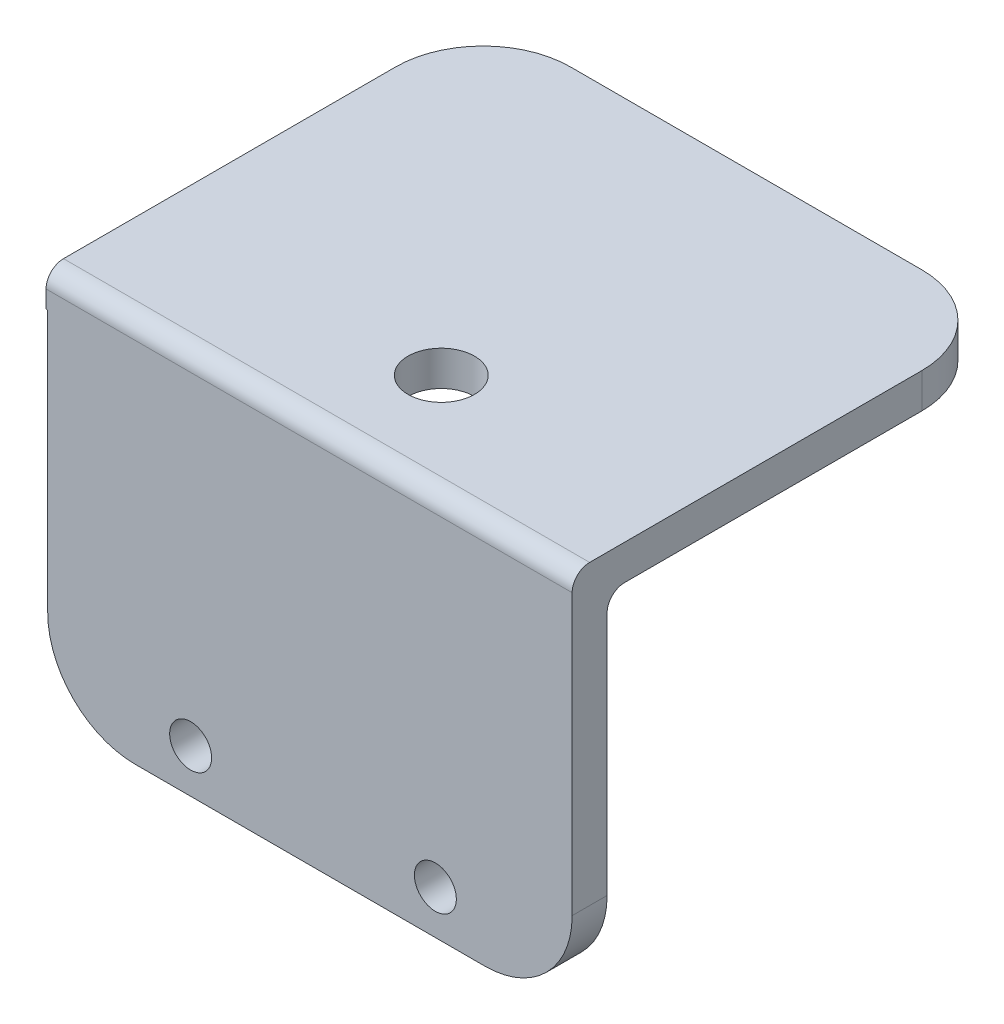
ISO-10303-21;
HEADER;
FILE_DESCRIPTION(('STEP AP214'),'2;1');
FILE_NAME('part.step','',(''),(''),'','','');
FILE_SCHEMA(('AUTOMOTIVE_DESIGN { 1 0 10303 214 1 1 1 1 }'));
ENDSEC;
DATA;
#1=APPLICATION_CONTEXT('core data for automotive mechanical design processes');
#2=APPLICATION_PROTOCOL_DEFINITION('international standard','automotive_design',2000,#1);
#3=PRODUCT_CONTEXT('',#1,'mechanical');
#4=PRODUCT('Part','Part','',(#3));
#5=PRODUCT_RELATED_PRODUCT_CATEGORY('part','',(#4));
#6=PRODUCT_DEFINITION_FORMATION('','',#4);
#7=PRODUCT_DEFINITION_CONTEXT('part definition',#1,'design');
#8=PRODUCT_DEFINITION('design','',#6,#7);
#9=PRODUCT_DEFINITION_SHAPE('','',#8);
#10=(LENGTH_UNIT() NAMED_UNIT(*) SI_UNIT(.MILLI.,.METRE.));
#11=(NAMED_UNIT(*) PLANE_ANGLE_UNIT() SI_UNIT($,.RADIAN.));
#12=(NAMED_UNIT(*) SI_UNIT($,.STERADIAN.) SOLID_ANGLE_UNIT());
#13=UNCERTAINTY_MEASURE_WITH_UNIT(LENGTH_MEASURE(1.E-05),#10,'distance_accuracy_value','');
#14=(GEOMETRIC_REPRESENTATION_CONTEXT(3) GLOBAL_UNCERTAINTY_ASSIGNED_CONTEXT((#13)) GLOBAL_UNIT_ASSIGNED_CONTEXT((#10,
#11,#12)) REPRESENTATION_CONTEXT('',''));
#15=CARTESIAN_POINT('',(0.,0.,0.));
#16=DIRECTION('',(0.,0.,1.));
#17=DIRECTION('',(1.,0.,0.));
#18=AXIS2_PLACEMENT_3D('',#15,#16,#17);
#19=CARTESIAN_POINT('',(2.62467610196418,-0.400000000000136,2.));
#20=DIRECTION('',(-1.,0.,0.));
#21=DIRECTION('',(0.,0.,1.));
#22=AXIS2_PLACEMENT_3D('',#19,#20,#21);
#23=PLANE('',#22);
#24=DIRECTION('',(0.,0.,-1.));
#25=VECTOR('',#24,1.);
#26=CARTESIAN_POINT('',(2.62467610196418,19.5999999999999,2.));
#27=LINE('',#26,#25);
#28=CARTESIAN_POINT('',(2.62467610196418,19.5999999999999,-1.));
#29=VERTEX_POINT('',#28);
#30=CARTESIAN_POINT('',(2.62467610196418,19.5999999999999,-18.));
#31=VERTEX_POINT('',#30);
#32=EDGE_CURVE('E144',#29,#31,#27,.T.);
#33=ORIENTED_EDGE('',*,*,#32,.T.);
#34=DIRECTION('',(0.,1.,0.));
#35=VECTOR('',#34,1.);
#36=CARTESIAN_POINT('',(2.62467610196418,21.5999999999999,-18.));
#37=LINE('',#36,#35);
#38=CARTESIAN_POINT('',(2.62467610196418,21.5999999999999,-18.));
#39=VERTEX_POINT('',#38);
#40=EDGE_CURVE('E11',#31,#39,#37,.T.);
#41=ORIENTED_EDGE('',*,*,#40,.T.);
#42=DIRECTION('',(0.,0.,-1.));
#43=VECTOR('',#42,1.);
#44=CARTESIAN_POINT('',(2.62467610196418,21.5999999999999,2.));
#45=LINE('',#44,#43);
#46=CARTESIAN_POINT('',(2.62467610196418,21.5999999999999,1.));
#47=VERTEX_POINT('',#46);
#48=EDGE_CURVE('E177',#47,#39,#45,.T.);
#49=ORIENTED_EDGE('',*,*,#48,.F.);
#50=CARTESIAN_POINT('',(2.62467610196418,20.5999999999999,1.));
#51=DIRECTION('',(-1.,0.,0.));
#52=DIRECTION('',(0.,0.,1.));
#53=AXIS2_PLACEMENT_3D('',#50,#51,#52);
#54=CIRCLE('',#53,1.);
#55=CARTESIAN_POINT('',(2.62467610196418,20.5999999999999,2.));
#56=VERTEX_POINT('',#55);
#57=EDGE_CURVE('E200',#47,#56,#54,.F.);
#58=ORIENTED_EDGE('',*,*,#57,.T.);
#59=DIRECTION('',(0.,1.,0.));
#60=VECTOR('',#59,1.);
#61=CARTESIAN_POINT('',(2.62467610196418,-0.400000000000136,2.));
#62=LINE('',#61,#60);
#63=CARTESIAN_POINT('',(2.62467610196418,4.59999999999986,2.));
#64=VERTEX_POINT('',#63);
#65=EDGE_CURVE('E170',#64,#56,#62,.T.);
#66=ORIENTED_EDGE('',*,*,#65,.F.);
#67=DIRECTION('',(0.,0.,-1.));
#68=VECTOR('',#67,1.);
#69=CARTESIAN_POINT('',(2.62467610196418,4.59999999999986,2.));
#70=LINE('',#69,#68);
#71=CARTESIAN_POINT('',(2.62467610196418,4.59999999999986,0.));
#72=VERTEX_POINT('',#71);
#73=EDGE_CURVE('E203',#64,#72,#70,.T.);
#74=ORIENTED_EDGE('',*,*,#73,.T.);
#75=DIRECTION('',(0.,1.,0.));
#76=VECTOR('',#75,1.);
#77=CARTESIAN_POINT('',(2.62467610196418,-0.400000000000136,0.));
#78=LINE('',#77,#76);
#79=CARTESIAN_POINT('',(2.62467610196418,18.5999999999999,0.));
#80=VERTEX_POINT('',#79);
#81=EDGE_CURVE('E169',#72,#80,#78,.T.);
#82=ORIENTED_EDGE('',*,*,#81,.T.);
#83=CARTESIAN_POINT('',(2.62467610196418,18.5999999999999,-1.));
#84=DIRECTION('',(-1.,0.,0.));
#85=DIRECTION('',(0.,0.,1.));
#86=AXIS2_PLACEMENT_3D('',#83,#84,#85);
#87=CIRCLE('',#86,1.);
#88=EDGE_CURVE('E191',#80,#29,#87,.T.);
#89=ORIENTED_EDGE('',*,*,#88,.T.);
#90=EDGE_LOOP('',(#33,#41,#49,#58,#66,#74,#82,#89));
#91=FACE_BOUND('',#90,.T.);
#92=ADVANCED_FACE('F37',(#91),#23,.F.);
#93=CARTESIAN_POINT('',(2.62467610196418,21.5999999999999,2.));
#94=DIRECTION('',(0.,-1.,0.));
#95=DIRECTION('',(0.,0.,-1.));
#96=AXIS2_PLACEMENT_3D('',#93,#94,#95);
#97=PLANE('',#96);
#98=CARTESIAN_POINT('',(-10.8906381891158,21.5999999999999,-4.02767022661771));
#99=DIRECTION('',(0.,1.,0.));
#100=DIRECTION('',(0.,0.,1.));
#101=AXIS2_PLACEMENT_3D('',#98,#99,#100);
#102=CIRCLE('',#101,1.90000000000001);
#103=CARTESIAN_POINT('',(-10.8906381891158,21.5999999999999,-2.1276702266177));
#104=VERTEX_POINT('',#103);
#105=EDGE_CURVE('E348',#104,#104,#102,.T.);
#106=ORIENTED_EDGE('',*,*,#105,.F.);
#107=EDGE_LOOP('',(#106));
#108=FACE_BOUND('',#107,.T.);
#109=DIRECTION('',(-1.,0.,0.));
#110=VECTOR('',#109,1.);
#111=CARTESIAN_POINT('',(2.62467610196418,21.5999999999999,-23.));
#112=LINE('',#111,#110);
#113=CARTESIAN_POINT('',(-2.37532389803582,21.5999999999999,-23.));
#114=VERTEX_POINT('',#113);
#115=CARTESIAN_POINT('',(-22.4723601052632,21.5999999999999,-23.));
#116=VERTEX_POINT('',#115);
#117=EDGE_CURVE('E163',#114,#116,#112,.T.);
#118=ORIENTED_EDGE('',*,*,#117,.T.);
#119=CARTESIAN_POINT('',(-22.4723601052632,21.5999999999999,-18.));
#120=DIRECTION('',(0.,-1.,0.));
#121=DIRECTION('',(0.,0.,-1.));
#122=AXIS2_PLACEMENT_3D('',#119,#120,#121);
#123=CIRCLE('',#122,5.);
#124=CARTESIAN_POINT('',(-27.4723601052632,21.5999999999999,-18.));
#125=VERTEX_POINT('',#124);
#126=EDGE_CURVE('E228',#116,#125,#123,.F.);
#127=ORIENTED_EDGE('',*,*,#126,.T.);
#128=DIRECTION('',(0.,0.,-1.));
#129=VECTOR('',#128,1.);
#130=CARTESIAN_POINT('',(-27.4723601052632,21.5999999999999,2.));
#131=LINE('',#130,#129);
#132=CARTESIAN_POINT('',(-27.4723601052632,21.5999999999999,1.));
#133=VERTEX_POINT('',#132);
#134=EDGE_CURVE('E158',#133,#125,#131,.T.);
#135=ORIENTED_EDGE('',*,*,#134,.F.);
#136=DIRECTION('',(-1.,0.,0.));
#137=VECTOR('',#136,1.);
#138=CARTESIAN_POINT('',(2.62467610196418,21.5999999999999,1.));
#139=LINE('',#138,#137);
#140=EDGE_CURVE('E198',#133,#47,#139,.F.);
#141=ORIENTED_EDGE('',*,*,#140,.T.);
#142=ORIENTED_EDGE('',*,*,#48,.T.);
#143=CARTESIAN_POINT('',(-2.37532389803582,21.5999999999999,-18.));
#144=DIRECTION('',(0.,-1.,0.));
#145=DIRECTION('',(0.,0.,-1.));
#146=AXIS2_PLACEMENT_3D('',#143,#144,#145);
#147=CIRCLE('',#146,5.);
#148=EDGE_CURVE('E226',#39,#114,#147,.F.);
#149=ORIENTED_EDGE('',*,*,#148,.T.);
#150=EDGE_LOOP('',(#118,#127,#135,#141,#142,#149));
#151=FACE_BOUND('',#150,.T.);
#152=ADVANCED_FACE('F240',(#108,#151),#97,.F.);
#153=CARTESIAN_POINT('',(-27.3753238980358,-0.40000000000014,2.));
#154=DIRECTION('',(1.,0.,0.));
#155=DIRECTION('',(0.,0.,-1.));
#156=AXIS2_PLACEMENT_3D('',#153,#154,#155);
#157=PLANE('',#156);
#158=DIRECTION('',(0.,-1.,0.));
#159=VECTOR('',#158,1.);
#160=CARTESIAN_POINT('',(-27.3753238980358,-0.40000000000014,0.));
#161=LINE('',#160,#159);
#162=CARTESIAN_POINT('',(-27.3753238980358,18.5999999999999,0.));
#163=VERTEX_POINT('',#162);
#164=CARTESIAN_POINT('',(-27.3753238980358,4.59999999999986,0.));
#165=VERTEX_POINT('',#164);
#166=EDGE_CURVE('E179',#163,#165,#161,.T.);
#167=ORIENTED_EDGE('',*,*,#166,.T.);
#168=DIRECTION('',(0.,0.,-1.));
#169=VECTOR('',#168,1.);
#170=CARTESIAN_POINT('',(-27.3753238980358,4.59999999999986,2.));
#171=LINE('',#170,#169);
#172=CARTESIAN_POINT('',(-27.3753238980358,4.59999999999986,2.));
#173=VERTEX_POINT('',#172);
#174=EDGE_CURVE('E219',#165,#173,#171,.F.);
#175=ORIENTED_EDGE('',*,*,#174,.T.);
#176=DIRECTION('',(0.,-1.,0.));
#177=VECTOR('',#176,1.);
#178=CARTESIAN_POINT('',(-27.3753238980358,-0.40000000000014,2.));
#179=LINE('',#178,#177);
#180=CARTESIAN_POINT('',(-27.3753238980358,19.5999999999999,2.));
#181=VERTEX_POINT('',#180);
#182=EDGE_CURVE('E172',#181,#173,#179,.T.);
#183=ORIENTED_EDGE('',*,*,#182,.F.);
#184=DIRECTION('',(0.,0.,-1.));
#185=VECTOR('',#184,1.);
#186=CARTESIAN_POINT('',(-27.3753238980358,19.5999999999999,2.));
#187=LINE('',#186,#185);
#188=CARTESIAN_POINT('',(-27.3753238980358,19.5999999999999,-1.));
#189=VERTEX_POINT('',#188);
#190=EDGE_CURVE('E140',#181,#189,#187,.T.);
#191=ORIENTED_EDGE('',*,*,#190,.T.);
#192=CARTESIAN_POINT('',(-27.3753238980358,18.5999999999999,-1.));
#193=DIRECTION('',(1.,0.,0.));
#194=DIRECTION('',(0.,0.,-1.));
#195=AXIS2_PLACEMENT_3D('',#192,#193,#194);
#196=CIRCLE('',#195,1.);
#197=EDGE_CURVE('E193',#189,#163,#196,.T.);
#198=ORIENTED_EDGE('',*,*,#197,.T.);
#199=EDGE_LOOP('',(#167,#175,#183,#191,#198));
#200=FACE_BOUND('',#199,.T.);
#201=ADVANCED_FACE('F264',(#200),#157,.F.);
#202=CARTESIAN_POINT('',(2.62467610196418,-0.400000000000136,2.));
#203=DIRECTION('',(0.,1.,0.));
#204=DIRECTION('',(-1.,0.,0.));
#205=AXIS2_PLACEMENT_3D('',#202,#203,#204);
#206=PLANE('',#205);
#207=DIRECTION('',(1.,0.,0.));
#208=VECTOR('',#207,1.);
#209=CARTESIAN_POINT('',(2.62467610196418,-0.400000000000136,0.));
#210=LINE('',#209,#208);
#211=CARTESIAN_POINT('',(-22.3753238980358,-0.400000000000139,0.));
#212=VERTEX_POINT('',#211);
#213=CARTESIAN_POINT('',(-2.37532389803582,-0.400000000000137,0.));
#214=VERTEX_POINT('',#213);
#215=EDGE_CURVE('E173',#212,#214,#210,.T.);
#216=ORIENTED_EDGE('',*,*,#215,.T.);
#217=DIRECTION('',(0.,0.,-1.));
#218=VECTOR('',#217,1.);
#219=CARTESIAN_POINT('',(-2.37532389803582,-0.400000000000137,2.));
#220=LINE('',#219,#218);
#221=CARTESIAN_POINT('',(-2.37532389803582,-0.400000000000137,2.));
#222=VERTEX_POINT('',#221);
#223=EDGE_CURVE('E213',#214,#222,#220,.F.);
#224=ORIENTED_EDGE('',*,*,#223,.T.);
#225=DIRECTION('',(1.,0.,0.));
#226=VECTOR('',#225,1.);
#227=CARTESIAN_POINT('',(2.62467610196418,-0.400000000000136,2.));
#228=LINE('',#227,#226);
#229=CARTESIAN_POINT('',(-22.3753238980358,-0.400000000000139,2.));
#230=VERTEX_POINT('',#229);
#231=EDGE_CURVE('E175',#230,#222,#228,.T.);
#232=ORIENTED_EDGE('',*,*,#231,.F.);
#233=DIRECTION('',(0.,0.,-1.));
#234=VECTOR('',#233,1.);
#235=CARTESIAN_POINT('',(-22.3753238980358,-0.400000000000139,2.));
#236=LINE('',#235,#234);
#237=EDGE_CURVE('E210',#230,#212,#236,.T.);
#238=ORIENTED_EDGE('',*,*,#237,.T.);
#239=EDGE_LOOP('',(#216,#224,#232,#238));
#240=FACE_BOUND('',#239,.T.);
#241=ADVANCED_FACE('F290',(#240),#206,.F.);
#242=CARTESIAN_POINT('',(0.,0.,2.));
#243=DIRECTION('',(0.,0.,1.));
#244=DIRECTION('',(1.,0.,0.));
#245=AXIS2_PLACEMENT_3D('',#242,#243,#244);
#246=PLANE('',#245);
#247=CARTESIAN_POINT('',(-5.2,2.09999999999999,2.));
#248=DIRECTION('',(0.,0.,1.));
#249=DIRECTION('',(1.,0.,0.));
#250=AXIS2_PLACEMENT_3D('',#247,#248,#249);
#251=CIRCLE('',#250,1.2);
#252=CARTESIAN_POINT('',(-4.,2.09999999999999,2.));
#253=VERTEX_POINT('',#252);
#254=EDGE_CURVE('E335',#253,#253,#251,.T.);
#255=ORIENTED_EDGE('',*,*,#254,.F.);
#256=EDGE_LOOP('',(#255));
#257=FACE_BOUND('',#256,.T.);
#258=CARTESIAN_POINT('',(-19.2,2.09999999999999,2.));
#259=DIRECTION('',(0.,0.,1.));
#260=DIRECTION('',(1.,0.,0.));
#261=AXIS2_PLACEMENT_3D('',#258,#259,#260);
#262=CIRCLE('',#261,1.2);
#263=CARTESIAN_POINT('',(-18.,2.09999999999999,2.));
#264=VERTEX_POINT('',#263);
#265=EDGE_CURVE('E340',#264,#264,#262,.T.);
#266=ORIENTED_EDGE('',*,*,#265,.F.);
#267=EDGE_LOOP('',(#266));
#268=FACE_BOUND('',#267,.T.);
#269=ORIENTED_EDGE('',*,*,#231,.T.);
#270=CARTESIAN_POINT('',(-2.37532389803582,4.59999999999986,2.));
#271=DIRECTION('',(0.,0.,1.));
#272=DIRECTION('',(1.,0.,0.));
#273=AXIS2_PLACEMENT_3D('',#270,#271,#272);
#274=CIRCLE('',#273,5.);
#275=EDGE_CURVE('E217',#222,#64,#274,.T.);
#276=ORIENTED_EDGE('',*,*,#275,.T.);
#277=ORIENTED_EDGE('',*,*,#65,.T.);
#278=DIRECTION('',(-1.,0.,0.));
#279=VECTOR('',#278,1.);
#280=CARTESIAN_POINT('',(-27.4723601052632,20.5999999999999,2.));
#281=LINE('',#280,#279);
#282=CARTESIAN_POINT('',(-27.4723601052632,20.5999999999999,2.));
#283=VERTEX_POINT('',#282);
#284=EDGE_CURVE('E152',#56,#283,#281,.T.);
#285=ORIENTED_EDGE('',*,*,#284,.T.);
#286=DIRECTION('',(0.,1.,0.));
#287=VECTOR('',#286,1.);
#288=CARTESIAN_POINT('',(-27.4723601052632,19.5999999999999,2.));
#289=LINE('',#288,#287);
#290=CARTESIAN_POINT('',(-27.4723601052632,19.5999999999999,2.));
#291=VERTEX_POINT('',#290);
#292=EDGE_CURVE('E148',#291,#283,#289,.T.);
#293=ORIENTED_EDGE('',*,*,#292,.F.);
#294=DIRECTION('',(-1.,0.,0.));
#295=VECTOR('',#294,1.);
#296=CARTESIAN_POINT('',(2.62467610196418,19.5999999999999,2.));
#297=LINE('',#296,#295);
#298=EDGE_CURVE('E134',#181,#291,#297,.T.);
#299=ORIENTED_EDGE('',*,*,#298,.F.);
#300=ORIENTED_EDGE('',*,*,#182,.T.);
#301=CARTESIAN_POINT('',(-22.3753238980358,4.59999999999986,2.));
#302=DIRECTION('',(0.,0.,1.));
#303=DIRECTION('',(1.,0.,0.));
#304=AXIS2_PLACEMENT_3D('',#301,#302,#303);
#305=CIRCLE('',#304,5.);
#306=EDGE_CURVE('E215',#173,#230,#305,.T.);
#307=ORIENTED_EDGE('',*,*,#306,.T.);
#308=EDGE_LOOP('',(#269,#276,#277,#285,#293,#299,#300,#307));
#309=FACE_BOUND('',#308,.T.);
#310=ADVANCED_FACE('F150',(#257,#268,#309),#246,.T.);
#311=CARTESIAN_POINT('',(0.,0.,0.));
#312=DIRECTION('',(0.,0.,1.));
#313=DIRECTION('',(1.,0.,0.));
#314=AXIS2_PLACEMENT_3D('',#311,#312,#313);
#315=PLANE('',#314);
#316=CARTESIAN_POINT('',(-5.2,2.09999999999999,0.));
#317=DIRECTION('',(0.,0.,1.));
#318=DIRECTION('',(1.,0.,0.));
#319=AXIS2_PLACEMENT_3D('',#316,#317,#318);
#320=CIRCLE('',#319,1.2);
#321=CARTESIAN_POINT('',(-4.,2.09999999999999,0.));
#322=VERTEX_POINT('',#321);
#323=EDGE_CURVE('E166',#322,#322,#320,.T.);
#324=ORIENTED_EDGE('',*,*,#323,.T.);
#325=EDGE_LOOP('',(#324));
#326=FACE_BOUND('',#325,.T.);
#327=CARTESIAN_POINT('',(-19.2,2.09999999999999,0.));
#328=DIRECTION('',(0.,0.,1.));
#329=DIRECTION('',(1.,0.,0.));
#330=AXIS2_PLACEMENT_3D('',#327,#328,#329);
#331=CIRCLE('',#330,1.2);
#332=CARTESIAN_POINT('',(-18.,2.09999999999999,0.));
#333=VERTEX_POINT('',#332);
#334=EDGE_CURVE('E336',#333,#333,#331,.T.);
#335=ORIENTED_EDGE('',*,*,#334,.T.);
#336=EDGE_LOOP('',(#335));
#337=FACE_BOUND('',#336,.T.);
#338=ORIENTED_EDGE('',*,*,#81,.F.);
#339=CARTESIAN_POINT('',(-2.37532389803582,4.59999999999986,0.));
#340=DIRECTION('',(0.,0.,1.));
#341=DIRECTION('',(1.,0.,0.));
#342=AXIS2_PLACEMENT_3D('',#339,#340,#341);
#343=CIRCLE('',#342,5.);
#344=EDGE_CURVE('E208',#72,#214,#343,.F.);
#345=ORIENTED_EDGE('',*,*,#344,.T.);
#346=ORIENTED_EDGE('',*,*,#215,.F.);
#347=CARTESIAN_POINT('',(-22.3753238980358,4.59999999999986,0.));
#348=DIRECTION('',(0.,0.,1.));
#349=DIRECTION('',(1.,0.,0.));
#350=AXIS2_PLACEMENT_3D('',#347,#348,#349);
#351=CIRCLE('',#350,5.);
#352=EDGE_CURVE('E206',#212,#165,#351,.F.);
#353=ORIENTED_EDGE('',*,*,#352,.T.);
#354=ORIENTED_EDGE('',*,*,#166,.F.);
#355=DIRECTION('',(1.,0.,0.));
#356=VECTOR('',#355,1.);
#357=CARTESIAN_POINT('',(0.,18.5999999999999,0.));
#358=LINE('',#357,#356);
#359=EDGE_CURVE('E186',#163,#80,#358,.T.);
#360=ORIENTED_EDGE('',*,*,#359,.T.);
#361=EDGE_LOOP('',(#338,#345,#346,#353,#354,#360));
#362=FACE_BOUND('',#361,.T.);
#363=ADVANCED_FACE('F297',(#326,#337,#362),#315,.F.);
#364=CARTESIAN_POINT('',(0.,19.5999999999999,0.));
#365=DIRECTION('',(0.,-1.,0.));
#366=DIRECTION('',(0.,0.,-1.));
#367=AXIS2_PLACEMENT_3D('',#364,#365,#366);
#368=PLANE('',#367);
#369=CARTESIAN_POINT('',(-10.8906381891158,19.5999999999999,-4.02767022661771));
#370=DIRECTION('',(0.,1.,0.));
#371=DIRECTION('',(0.,0.,1.));
#372=AXIS2_PLACEMENT_3D('',#369,#370,#371);
#373=CIRCLE('',#372,1.90000000000001);
#374=CARTESIAN_POINT('',(-10.8906381891158,19.5999999999999,-2.1276702266177));
#375=VERTEX_POINT('',#374);
#376=EDGE_CURVE('E344',#375,#375,#373,.T.);
#377=ORIENTED_EDGE('',*,*,#376,.T.);
#378=EDGE_LOOP('',(#377));
#379=FACE_BOUND('',#378,.T.);
#380=DIRECTION('',(0.,0.,-1.));
#381=VECTOR('',#380,1.);
#382=CARTESIAN_POINT('',(-27.4723601052632,19.5999999999999,2.));
#383=LINE('',#382,#381);
#384=CARTESIAN_POINT('',(-27.4723601052632,19.5999999999999,-18.));
#385=VERTEX_POINT('',#384);
#386=EDGE_CURVE('E137',#291,#385,#383,.T.);
#387=ORIENTED_EDGE('',*,*,#386,.T.);
#388=CARTESIAN_POINT('',(-22.4723601052632,19.5999999999999,-18.));
#389=DIRECTION('',(0.,-1.,0.));
#390=DIRECTION('',(0.,0.,-1.));
#391=AXIS2_PLACEMENT_3D('',#388,#389,#390);
#392=CIRCLE('',#391,5.);
#393=CARTESIAN_POINT('',(-22.4723601052632,19.5999999999999,-23.));
#394=VERTEX_POINT('',#393);
#395=EDGE_CURVE('E45',#385,#394,#392,.T.);
#396=ORIENTED_EDGE('',*,*,#395,.T.);
#397=DIRECTION('',(-1.,0.,0.));
#398=VECTOR('',#397,1.);
#399=CARTESIAN_POINT('',(2.62467610196418,19.5999999999999,-23.));
#400=LINE('',#399,#398);
#401=CARTESIAN_POINT('',(-2.37532389803582,19.5999999999999,-23.));
#402=VERTEX_POINT('',#401);
#403=EDGE_CURVE('E155',#402,#394,#400,.T.);
#404=ORIENTED_EDGE('',*,*,#403,.F.);
#405=CARTESIAN_POINT('',(-2.37532389803582,19.5999999999999,-18.));
#406=DIRECTION('',(0.,-1.,0.));
#407=DIRECTION('',(0.,0.,-1.));
#408=AXIS2_PLACEMENT_3D('',#405,#406,#407);
#409=CIRCLE('',#408,5.);
#410=EDGE_CURVE('E52',#402,#31,#409,.T.);
#411=ORIENTED_EDGE('',*,*,#410,.T.);
#412=ORIENTED_EDGE('',*,*,#32,.F.);
#413=DIRECTION('',(1.,0.,0.));
#414=VECTOR('',#413,1.);
#415=CARTESIAN_POINT('',(0.,19.5999999999999,-1.));
#416=LINE('',#415,#414);
#417=EDGE_CURVE('E189',#29,#189,#416,.F.);
#418=ORIENTED_EDGE('',*,*,#417,.T.);
#419=ORIENTED_EDGE('',*,*,#190,.F.);
#420=ORIENTED_EDGE('',*,*,#298,.T.);
#421=EDGE_LOOP('',(#387,#396,#404,#411,#412,#418,#419,#420));
#422=FACE_BOUND('',#421,.T.);
#423=ADVANCED_FACE('F136',(#379,#422),#368,.T.);
#424=CARTESIAN_POINT('',(2.62467610196418,19.5999999999999,-23.));
#425=DIRECTION('',(0.,0.,-1.));
#426=DIRECTION('',(-1.,0.,0.));
#427=AXIS2_PLACEMENT_3D('',#424,#425,#426);
#428=PLANE('',#427);
#429=ORIENTED_EDGE('',*,*,#403,.T.);
#430=DIRECTION('',(0.,1.,0.));
#431=VECTOR('',#430,1.);
#432=CARTESIAN_POINT('',(-22.4723601052632,21.5999999999999,-23.));
#433=LINE('',#432,#431);
#434=EDGE_CURVE('E223',#394,#116,#433,.T.);
#435=ORIENTED_EDGE('',*,*,#434,.T.);
#436=ORIENTED_EDGE('',*,*,#117,.F.);
#437=DIRECTION('',(0.,1.,0.));
#438=VECTOR('',#437,1.);
#439=CARTESIAN_POINT('',(-2.37532389803582,19.5999999999999,-23.));
#440=LINE('',#439,#438);
#441=EDGE_CURVE('E221',#114,#402,#440,.F.);
#442=ORIENTED_EDGE('',*,*,#441,.T.);
#443=EDGE_LOOP('',(#429,#435,#436,#442));
#444=FACE_BOUND('',#443,.T.);
#445=ADVANCED_FACE('F234',(#444),#428,.T.);
#446=CARTESIAN_POINT('',(-27.4723601052632,19.5999999999999,2.));
#447=DIRECTION('',(1.,0.,0.));
#448=DIRECTION('',(0.,0.,-1.));
#449=AXIS2_PLACEMENT_3D('',#446,#447,#448);
#450=PLANE('',#449);
#451=ORIENTED_EDGE('',*,*,#134,.T.);
#452=DIRECTION('',(0.,1.,0.));
#453=VECTOR('',#452,1.);
#454=CARTESIAN_POINT('',(-27.4723601052632,19.5999999999999,-18.));
#455=LINE('',#454,#453);
#456=EDGE_CURVE('E60',#125,#385,#455,.F.);
#457=ORIENTED_EDGE('',*,*,#456,.T.);
#458=ORIENTED_EDGE('',*,*,#386,.F.);
#459=ORIENTED_EDGE('',*,*,#292,.T.);
#460=CARTESIAN_POINT('',(-27.4723601052632,20.5999999999999,1.));
#461=DIRECTION('',(1.,0.,0.));
#462=DIRECTION('',(0.,0.,-1.));
#463=AXIS2_PLACEMENT_3D('',#460,#461,#462);
#464=CIRCLE('',#463,1.);
#465=EDGE_CURVE('E196',#283,#133,#464,.F.);
#466=ORIENTED_EDGE('',*,*,#465,.T.);
#467=EDGE_LOOP('',(#451,#457,#458,#459,#466));
#468=FACE_BOUND('',#467,.T.);
#469=ADVANCED_FACE('F154',(#468),#450,.F.);
#470=CARTESIAN_POINT('',(-19.2,2.09999999999999,0.));
#471=DIRECTION('',(0.,0.,1.));
#472=DIRECTION('',(1.,0.,0.));
#473=AXIS2_PLACEMENT_3D('',#470,#471,#472);
#474=CYLINDRICAL_SURFACE('',#473,1.2);
#475=ORIENTED_EDGE('',*,*,#334,.F.);
#476=EDGE_LOOP('',(#475));
#477=FACE_BOUND('',#476,.T.);
#478=ORIENTED_EDGE('',*,*,#265,.T.);
#479=EDGE_LOOP('',(#478));
#480=FACE_BOUND('',#479,.T.);
#481=ADVANCED_FACE('F319',(#477,#480),#474,.F.);
#482=CARTESIAN_POINT('',(-5.2,2.09999999999999,0.));
#483=DIRECTION('',(0.,0.,1.));
#484=DIRECTION('',(1.,0.,0.));
#485=AXIS2_PLACEMENT_3D('',#482,#483,#484);
#486=CYLINDRICAL_SURFACE('',#485,1.2);
#487=ORIENTED_EDGE('',*,*,#323,.F.);
#488=EDGE_LOOP('',(#487));
#489=FACE_BOUND('',#488,.T.);
#490=ORIENTED_EDGE('',*,*,#254,.T.);
#491=EDGE_LOOP('',(#490));
#492=FACE_BOUND('',#491,.T.);
#493=ADVANCED_FACE('F272',(#489,#492),#486,.F.);
#494=CARTESIAN_POINT('',(0.,18.5999999999999,-1.));
#495=DIRECTION('',(1.,0.,0.));
#496=DIRECTION('',(0.,0.,-1.));
#497=AXIS2_PLACEMENT_3D('',#494,#495,#496);
#498=CYLINDRICAL_SURFACE('',#497,1.);
#499=ORIENTED_EDGE('',*,*,#197,.F.);
#500=ORIENTED_EDGE('',*,*,#417,.F.);
#501=ORIENTED_EDGE('',*,*,#88,.F.);
#502=ORIENTED_EDGE('',*,*,#359,.F.);
#503=EDGE_LOOP('',(#499,#500,#501,#502));
#504=FACE_BOUND('',#503,.T.);
#505=ADVANCED_FACE('F269',(#504),#498,.F.);
#506=CARTESIAN_POINT('',(0.,20.5999999999999,1.));
#507=DIRECTION('',(1.,0.,0.));
#508=DIRECTION('',(0.,0.,-1.));
#509=AXIS2_PLACEMENT_3D('',#506,#507,#508);
#510=CYLINDRICAL_SURFACE('',#509,1.);
#511=ORIENTED_EDGE('',*,*,#57,.F.);
#512=ORIENTED_EDGE('',*,*,#140,.F.);
#513=ORIENTED_EDGE('',*,*,#465,.F.);
#514=ORIENTED_EDGE('',*,*,#284,.F.);
#515=EDGE_LOOP('',(#511,#512,#513,#514));
#516=FACE_BOUND('',#515,.T.);
#517=ADVANCED_FACE('F244',(#516),#510,.T.);
#518=CARTESIAN_POINT('',(-2.37532389803582,4.59999999999986,2.));
#519=DIRECTION('',(0.,0.,-1.));
#520=DIRECTION('',(-1.,0.,0.));
#521=AXIS2_PLACEMENT_3D('',#518,#519,#520);
#522=CYLINDRICAL_SURFACE('',#521,5.);
#523=ORIENTED_EDGE('',*,*,#275,.F.);
#524=ORIENTED_EDGE('',*,*,#223,.F.);
#525=ORIENTED_EDGE('',*,*,#344,.F.);
#526=ORIENTED_EDGE('',*,*,#73,.F.);
#527=EDGE_LOOP('',(#523,#524,#525,#526));
#528=FACE_BOUND('',#527,.T.);
#529=ADVANCED_FACE('F276',(#528),#522,.T.);
#530=CARTESIAN_POINT('',(-22.3753238980358,4.59999999999986,2.));
#531=DIRECTION('',(0.,0.,-1.));
#532=DIRECTION('',(-1.,0.,0.));
#533=AXIS2_PLACEMENT_3D('',#530,#531,#532);
#534=CYLINDRICAL_SURFACE('',#533,5.);
#535=ORIENTED_EDGE('',*,*,#306,.F.);
#536=ORIENTED_EDGE('',*,*,#174,.F.);
#537=ORIENTED_EDGE('',*,*,#352,.F.);
#538=ORIENTED_EDGE('',*,*,#237,.F.);
#539=EDGE_LOOP('',(#535,#536,#537,#538));
#540=FACE_BOUND('',#539,.T.);
#541=ADVANCED_FACE('F258',(#540),#534,.T.);
#542=CARTESIAN_POINT('',(-22.4723601052632,19.5999999999999,-18.));
#543=DIRECTION('',(0.,-1.,0.));
#544=DIRECTION('',(0.,0.,-1.));
#545=AXIS2_PLACEMENT_3D('',#542,#543,#544);
#546=CYLINDRICAL_SURFACE('',#545,5.);
#547=ORIENTED_EDGE('',*,*,#395,.F.);
#548=ORIENTED_EDGE('',*,*,#456,.F.);
#549=ORIENTED_EDGE('',*,*,#126,.F.);
#550=ORIENTED_EDGE('',*,*,#434,.F.);
#551=EDGE_LOOP('',(#547,#548,#549,#550));
#552=FACE_BOUND('',#551,.T.);
#553=ADVANCED_FACE('F237',(#552),#546,.T.);
#554=CARTESIAN_POINT('',(-2.37532389803582,-0.400000000000136,-18.));
#555=DIRECTION('',(0.,-1.,0.));
#556=DIRECTION('',(0.,0.,-1.));
#557=AXIS2_PLACEMENT_3D('',#554,#555,#556);
#558=CYLINDRICAL_SURFACE('',#557,5.);
#559=ORIENTED_EDGE('',*,*,#410,.F.);
#560=ORIENTED_EDGE('',*,*,#441,.F.);
#561=ORIENTED_EDGE('',*,*,#148,.F.);
#562=ORIENTED_EDGE('',*,*,#40,.F.);
#563=EDGE_LOOP('',(#559,#560,#561,#562));
#564=FACE_BOUND('',#563,.T.);
#565=ADVANCED_FACE('F39',(#564),#558,.T.);
#566=CARTESIAN_POINT('',(-10.8906381891158,19.5999999999999,-4.02767022661771));
#567=DIRECTION('',(0.,1.,0.));
#568=DIRECTION('',(0.,0.,1.));
#569=AXIS2_PLACEMENT_3D('',#566,#567,#568);
#570=CYLINDRICAL_SURFACE('',#569,1.90000000000001);
#571=ORIENTED_EDGE('',*,*,#376,.F.);
#572=EDGE_LOOP('',(#571));
#573=FACE_BOUND('',#572,.T.);
#574=ORIENTED_EDGE('',*,*,#105,.T.);
#575=EDGE_LOOP('',(#574));
#576=FACE_BOUND('',#575,.T.);
#577=ADVANCED_FACE('F251',(#573,#576),#570,.F.);
#578=CLOSED_SHELL('',(#92,#152,#201,#241,#310,#363,#423,#445,#469,#481,#493,#505,#517,#529,#541,
#553,#565,#577));
#579=MANIFOLD_SOLID_BREP('B2',#578);
#580=ADVANCED_BREP_SHAPE_REPRESENTATION('',(#18,#579),#14);
#581=SHAPE_DEFINITION_REPRESENTATION(#9,#580);
ENDSEC;
END-ISO-10303-21;
